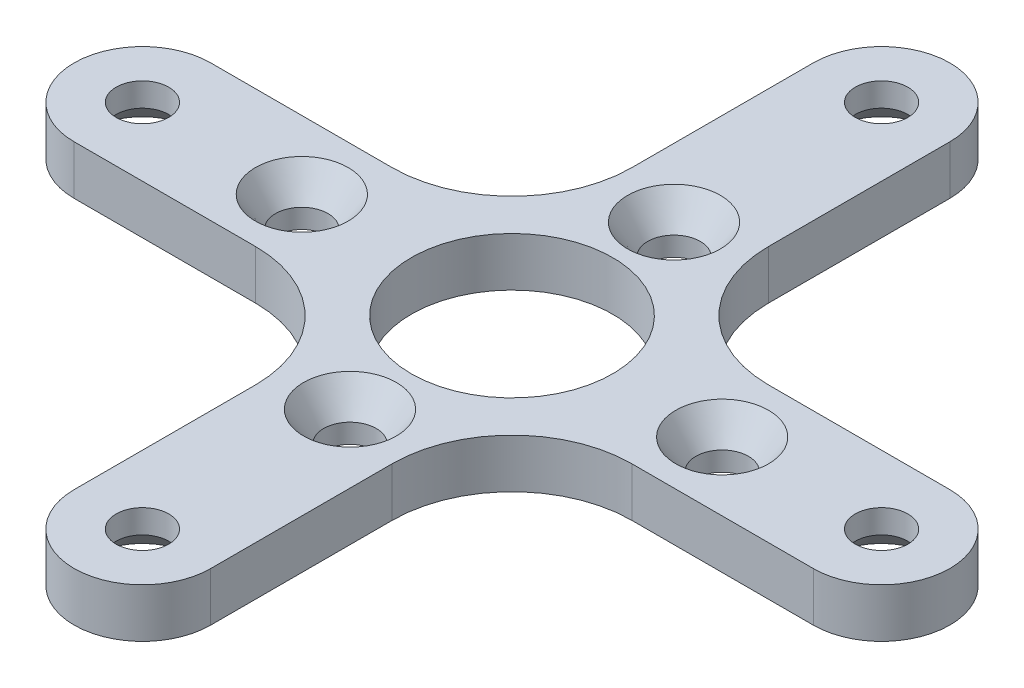
ISO-10303-21;
HEADER;
FILE_DESCRIPTION(('STEP AP214'),'2;1');
FILE_NAME('part.step','',(''),(''),'','','');
FILE_SCHEMA(('AUTOMOTIVE_DESIGN { 1 0 10303 214 1 1 1 1 }'));
ENDSEC;
DATA;
#1=APPLICATION_CONTEXT('core data for automotive mechanical design processes');
#2=APPLICATION_PROTOCOL_DEFINITION('international standard','automotive_design',2000,#1);
#3=PRODUCT_CONTEXT('',#1,'mechanical');
#4=PRODUCT('Part','Part','',(#3));
#5=PRODUCT_RELATED_PRODUCT_CATEGORY('part','',(#4));
#6=PRODUCT_DEFINITION_FORMATION('','',#4);
#7=PRODUCT_DEFINITION_CONTEXT('part definition',#1,'design');
#8=PRODUCT_DEFINITION('design','',#6,#7);
#9=PRODUCT_DEFINITION_SHAPE('','',#8);
#10=(LENGTH_UNIT() NAMED_UNIT(*) SI_UNIT(.MILLI.,.METRE.));
#11=(NAMED_UNIT(*) PLANE_ANGLE_UNIT() SI_UNIT($,.RADIAN.));
#12=(NAMED_UNIT(*) SI_UNIT($,.STERADIAN.) SOLID_ANGLE_UNIT());
#13=UNCERTAINTY_MEASURE_WITH_UNIT(LENGTH_MEASURE(1.E-05),#10,'distance_accuracy_value','');
#14=(GEOMETRIC_REPRESENTATION_CONTEXT(3) GLOBAL_UNCERTAINTY_ASSIGNED_CONTEXT((#13)) GLOBAL_UNIT_ASSIGNED_CONTEXT((#10,
#11,#12)) REPRESENTATION_CONTEXT('',''));
#15=CARTESIAN_POINT('',(0.,0.,0.));
#16=DIRECTION('',(0.,0.,1.));
#17=DIRECTION('',(1.,0.,0.));
#18=AXIS2_PLACEMENT_3D('',#15,#16,#17);
#19=CARTESIAN_POINT('',(0.,1.4,-21.1));
#20=DIRECTION('',(0.,-1.,0.));
#21=DIRECTION('',(0.,0.,-1.));
#22=AXIS2_PLACEMENT_3D('',#19,#20,#21);
#23=PLANE('',#22);
#24=CARTESIAN_POINT('',(12.,1.4,0.));
#25=DIRECTION('',(0.,-1.,0.));
#26=DIRECTION('',(0.,0.,-1.));
#27=AXIS2_PLACEMENT_3D('',#24,#25,#26);
#28=CIRCLE('',#27,2.65);
#29=CARTESIAN_POINT('',(12.,1.4,-2.65));
#30=VERTEX_POINT('',#29);
#31=EDGE_CURVE('E339',#30,#30,#28,.T.);
#32=ORIENTED_EDGE('',*,*,#31,.T.);
#33=EDGE_LOOP('',(#32));
#34=FACE_BOUND('',#33,.T.);
#35=CARTESIAN_POINT('',(0.,1.4,-9.25));
#36=DIRECTION('',(0.,-1.,0.));
#37=DIRECTION('',(0.,0.,-1.));
#38=AXIS2_PLACEMENT_3D('',#35,#36,#37);
#39=CIRCLE('',#38,2.65);
#40=CARTESIAN_POINT('',(0.,1.4,-11.9));
#41=VERTEX_POINT('',#40);
#42=EDGE_CURVE('E335',#41,#41,#39,.T.);
#43=ORIENTED_EDGE('',*,*,#42,.T.);
#44=EDGE_LOOP('',(#43));
#45=FACE_BOUND('',#44,.T.);
#46=CARTESIAN_POINT('',(-12.,1.4,0.));
#47=DIRECTION('',(0.,-1.,0.));
#48=DIRECTION('',(0.,0.,-1.));
#49=AXIS2_PLACEMENT_3D('',#46,#47,#48);
#50=CIRCLE('',#49,2.65);
#51=CARTESIAN_POINT('',(-12.,1.4,-2.65));
#52=VERTEX_POINT('',#51);
#53=EDGE_CURVE('E331',#52,#52,#50,.T.);
#54=ORIENTED_EDGE('',*,*,#53,.T.);
#55=EDGE_LOOP('',(#54));
#56=FACE_BOUND('',#55,.T.);
#57=CARTESIAN_POINT('',(0.,1.4,9.25));
#58=DIRECTION('',(0.,-1.,0.));
#59=DIRECTION('',(0.,0.,-1.));
#60=AXIS2_PLACEMENT_3D('',#57,#58,#59);
#61=CIRCLE('',#60,2.65);
#62=CARTESIAN_POINT('',(0.,1.4,6.6));
#63=VERTEX_POINT('',#62);
#64=EDGE_CURVE('E327',#63,#63,#61,.T.);
#65=ORIENTED_EDGE('',*,*,#64,.T.);
#66=EDGE_LOOP('',(#65));
#67=FACE_BOUND('',#66,.T.);
#68=CARTESIAN_POINT('',(0.,1.4,-21.1));
#69=DIRECTION('',(0.,1.,0.));
#70=DIRECTION('',(0.,0.,-1.));
#71=AXIS2_PLACEMENT_3D('',#68,#69,#70);
#72=CIRCLE('',#71,3.9);
#73=CARTESIAN_POINT('',(3.89999999999999,1.4,-21.1));
#74=VERTEX_POINT('',#73);
#75=CARTESIAN_POINT('',(-3.9,1.4,-21.1));
#76=VERTEX_POINT('',#75);
#77=EDGE_CURVE('E237',#74,#76,#72,.T.);
#78=ORIENTED_EDGE('',*,*,#77,.T.);
#79=DIRECTION('',(0.,0.,1.));
#80=VECTOR('',#79,1.);
#81=CARTESIAN_POINT('',(-3.9,1.4,-21.1));
#82=LINE('',#81,#80);
#83=CARTESIAN_POINT('',(-3.9,1.4,-10.7432503525602));
#84=VERTEX_POINT('',#83);
#85=EDGE_CURVE('E125',#76,#84,#82,.T.);
#86=ORIENTED_EDGE('',*,*,#85,.T.);
#87=CARTESIAN_POINT('',(-10.7432503525602,1.4,-10.7432503525602));
#88=DIRECTION('',(0.,-1.,0.));
#89=DIRECTION('',(0.,0.,1.));
#90=AXIS2_PLACEMENT_3D('',#87,#88,#89);
#91=CIRCLE('',#90,6.84325035256015);
#92=CARTESIAN_POINT('',(-10.7432503525602,1.4,-3.9));
#93=VERTEX_POINT('',#92);
#94=EDGE_CURVE('E501',#84,#93,#91,.T.);
#95=ORIENTED_EDGE('',*,*,#94,.T.);
#96=DIRECTION('',(-1.,0.,0.));
#97=VECTOR('',#96,1.);
#98=CARTESIAN_POINT('',(-21.1,1.4,-3.9));
#99=LINE('',#98,#97);
#100=CARTESIAN_POINT('',(-21.1,1.4,-3.9));
#101=VERTEX_POINT('',#100);
#102=EDGE_CURVE('E504',#93,#101,#99,.T.);
#103=ORIENTED_EDGE('',*,*,#102,.T.);
#104=CARTESIAN_POINT('',(-21.1,1.4,0.));
#105=DIRECTION('',(0.,1.,0.));
#106=DIRECTION('',(0.,0.,-1.));
#107=AXIS2_PLACEMENT_3D('',#104,#105,#106);
#108=CIRCLE('',#107,3.9);
#109=CARTESIAN_POINT('',(-21.1,1.4,3.9));
#110=VERTEX_POINT('',#109);
#111=EDGE_CURVE('E507',#101,#110,#108,.T.);
#112=ORIENTED_EDGE('',*,*,#111,.T.);
#113=DIRECTION('',(1.,0.,0.));
#114=VECTOR('',#113,1.);
#115=CARTESIAN_POINT('',(-10.7432503525602,1.4,3.9));
#116=LINE('',#115,#114);
#117=CARTESIAN_POINT('',(-10.7432503525602,1.4,3.9));
#118=VERTEX_POINT('',#117);
#119=EDGE_CURVE('E510',#110,#118,#116,.T.);
#120=ORIENTED_EDGE('',*,*,#119,.T.);
#121=CARTESIAN_POINT('',(-10.7432503525602,1.4,10.7432503525602));
#122=DIRECTION('',(0.,-1.,0.));
#123=DIRECTION('',(0.,0.,1.));
#124=AXIS2_PLACEMENT_3D('',#121,#122,#123);
#125=CIRCLE('',#124,6.84325035256015);
#126=CARTESIAN_POINT('',(-3.9,1.4,10.7432503525602));
#127=VERTEX_POINT('',#126);
#128=EDGE_CURVE('E513',#118,#127,#125,.T.);
#129=ORIENTED_EDGE('',*,*,#128,.T.);
#130=DIRECTION('',(0.,0.,1.));
#131=VECTOR('',#130,1.);
#132=CARTESIAN_POINT('',(-3.9,1.4,21.1));
#133=LINE('',#132,#131);
#134=CARTESIAN_POINT('',(-3.9,1.4,21.1));
#135=VERTEX_POINT('',#134);
#136=EDGE_CURVE('E516',#127,#135,#133,.T.);
#137=ORIENTED_EDGE('',*,*,#136,.T.);
#138=CARTESIAN_POINT('',(0.,1.4,21.1));
#139=DIRECTION('',(0.,1.,0.));
#140=DIRECTION('',(0.,0.,-1.));
#141=AXIS2_PLACEMENT_3D('',#138,#139,#140);
#142=CIRCLE('',#141,3.89999999999999);
#143=CARTESIAN_POINT('',(3.9,1.4,21.1));
#144=VERTEX_POINT('',#143);
#145=EDGE_CURVE('E519',#135,#144,#142,.T.);
#146=ORIENTED_EDGE('',*,*,#145,.T.);
#147=DIRECTION('',(0.,0.,-1.));
#148=VECTOR('',#147,1.);
#149=CARTESIAN_POINT('',(3.90000000000001,1.4,10.7432503525602));
#150=LINE('',#149,#148);
#151=CARTESIAN_POINT('',(3.90000000000001,1.4,10.7432503525602));
#152=VERTEX_POINT('',#151);
#153=EDGE_CURVE('E522',#144,#152,#150,.T.);
#154=ORIENTED_EDGE('',*,*,#153,.T.);
#155=CARTESIAN_POINT('',(10.7432503525602,1.4,10.7432503525602));
#156=DIRECTION('',(0.,-1.,0.));
#157=DIRECTION('',(0.,0.,1.));
#158=AXIS2_PLACEMENT_3D('',#155,#156,#157);
#159=CIRCLE('',#158,6.84325035256015);
#160=CARTESIAN_POINT('',(10.7432503525602,1.4,3.9));
#161=VERTEX_POINT('',#160);
#162=EDGE_CURVE('E525',#152,#161,#159,.T.);
#163=ORIENTED_EDGE('',*,*,#162,.T.);
#164=DIRECTION('',(1.,0.,0.));
#165=VECTOR('',#164,1.);
#166=CARTESIAN_POINT('',(21.1,1.4,3.9));
#167=LINE('',#166,#165);
#168=CARTESIAN_POINT('',(21.1,1.4,3.9));
#169=VERTEX_POINT('',#168);
#170=EDGE_CURVE('E528',#161,#169,#167,.T.);
#171=ORIENTED_EDGE('',*,*,#170,.T.);
#172=CARTESIAN_POINT('',(21.1,1.4,0.));
#173=DIRECTION('',(0.,1.,0.));
#174=DIRECTION('',(0.,0.,-1.));
#175=AXIS2_PLACEMENT_3D('',#172,#173,#174);
#176=CIRCLE('',#175,3.9);
#177=CARTESIAN_POINT('',(21.1,1.4,-3.9));
#178=VERTEX_POINT('',#177);
#179=EDGE_CURVE('E168',#169,#178,#176,.T.);
#180=ORIENTED_EDGE('',*,*,#179,.T.);
#181=DIRECTION('',(-1.,0.,0.));
#182=VECTOR('',#181,1.);
#183=CARTESIAN_POINT('',(10.7432503525602,1.4,-3.9));
#184=LINE('',#183,#182);
#185=CARTESIAN_POINT('',(10.7432503525602,1.4,-3.9));
#186=VERTEX_POINT('',#185);
#187=EDGE_CURVE('E162',#178,#186,#184,.T.);
#188=ORIENTED_EDGE('',*,*,#187,.T.);
#189=CARTESIAN_POINT('',(10.7432503525602,1.4,-10.7432503525602));
#190=DIRECTION('',(0.,-1.,0.));
#191=DIRECTION('',(0.,0.,1.));
#192=AXIS2_PLACEMENT_3D('',#189,#190,#191);
#193=CIRCLE('',#192,6.84325035256015);
#194=CARTESIAN_POINT('',(3.90000000000001,1.4,-10.7432503525602));
#195=VERTEX_POINT('',#194);
#196=EDGE_CURVE('E166',#186,#195,#193,.T.);
#197=ORIENTED_EDGE('',*,*,#196,.T.);
#198=DIRECTION('',(0.,0.,-1.));
#199=VECTOR('',#198,1.);
#200=CARTESIAN_POINT('',(3.89999999999999,1.4,-21.1));
#201=LINE('',#200,#199);
#202=EDGE_CURVE('E57',#195,#74,#201,.T.);
#203=ORIENTED_EDGE('',*,*,#202,.T.);
#204=EDGE_LOOP('',(#78,#86,#95,#103,#112,#120,#129,#137,#146,#154,#163,#171,#180,#188,#197,#203));
#205=FACE_BOUND('',#204,.T.);
#206=CARTESIAN_POINT('',(0.,1.4,0.));
#207=DIRECTION('',(0.,1.,0.));
#208=DIRECTION('',(0.,0.,1.));
#209=AXIS2_PLACEMENT_3D('',#206,#207,#208);
#210=CIRCLE('',#209,5.75);
#211=CARTESIAN_POINT('',(0.,1.4,5.75));
#212=VERTEX_POINT('',#211);
#213=EDGE_CURVE('E195',#212,#212,#210,.T.);
#214=ORIENTED_EDGE('',*,*,#213,.F.);
#215=EDGE_LOOP('',(#214));
#216=FACE_BOUND('',#215,.T.);
#217=CARTESIAN_POINT('',(0.,1.4,-21.1));
#218=DIRECTION('',(0.,1.,0.));
#219=DIRECTION('',(0.,0.,1.));
#220=AXIS2_PLACEMENT_3D('',#217,#218,#219);
#221=CIRCLE('',#220,1.5);
#222=CARTESIAN_POINT('',(0.,1.4,-19.6));
#223=VERTEX_POINT('',#222);
#224=EDGE_CURVE('E474',#223,#223,#221,.T.);
#225=ORIENTED_EDGE('',*,*,#224,.F.);
#226=EDGE_LOOP('',(#225));
#227=FACE_BOUND('',#226,.T.);
#228=CARTESIAN_POINT('',(21.1,1.4,0.));
#229=DIRECTION('',(0.,1.,0.));
#230=DIRECTION('',(0.,0.,1.));
#231=AXIS2_PLACEMENT_3D('',#228,#229,#230);
#232=CIRCLE('',#231,1.5);
#233=CARTESIAN_POINT('',(21.1,1.4,1.5));
#234=VERTEX_POINT('',#233);
#235=EDGE_CURVE('E475',#234,#234,#232,.T.);
#236=ORIENTED_EDGE('',*,*,#235,.F.);
#237=EDGE_LOOP('',(#236));
#238=FACE_BOUND('',#237,.T.);
#239=CARTESIAN_POINT('',(0.,1.4,21.1));
#240=DIRECTION('',(0.,1.,0.));
#241=DIRECTION('',(0.,0.,1.));
#242=AXIS2_PLACEMENT_3D('',#239,#240,#241);
#243=CIRCLE('',#242,1.5);
#244=CARTESIAN_POINT('',(0.,1.4,22.6));
#245=VERTEX_POINT('',#244);
#246=EDGE_CURVE('E585',#245,#245,#243,.T.);
#247=ORIENTED_EDGE('',*,*,#246,.F.);
#248=EDGE_LOOP('',(#247));
#249=FACE_BOUND('',#248,.T.);
#250=CARTESIAN_POINT('',(-21.1,1.4,0.));
#251=DIRECTION('',(0.,1.,0.));
#252=DIRECTION('',(0.,0.,1.));
#253=AXIS2_PLACEMENT_3D('',#250,#251,#252);
#254=CIRCLE('',#253,1.5);
#255=CARTESIAN_POINT('',(-21.1,1.4,1.5));
#256=VERTEX_POINT('',#255);
#257=EDGE_CURVE('E588',#256,#256,#254,.T.);
#258=ORIENTED_EDGE('',*,*,#257,.F.);
#259=EDGE_LOOP('',(#258));
#260=FACE_BOUND('',#259,.T.);
#261=ADVANCED_FACE('F39',(#34,#45,#56,#67,#205,#216,#227,#238,#249,#260),#23,.F.);
#262=CARTESIAN_POINT('',(0.,-1.4,-21.1));
#263=DIRECTION('',(0.,-1.,0.));
#264=DIRECTION('',(0.,0.,-1.));
#265=AXIS2_PLACEMENT_3D('',#262,#263,#264);
#266=PLANE('',#265);
#267=CARTESIAN_POINT('',(-21.1,-1.4,0.));
#268=DIRECTION('',(0.,-1.,0.));
#269=DIRECTION('',(0.,0.,-1.));
#270=AXIS2_PLACEMENT_3D('',#267,#268,#269);
#271=CIRCLE('',#270,2.95000000000002);
#272=CARTESIAN_POINT('',(-21.1,-1.4,-2.95000000000002));
#273=VERTEX_POINT('',#272);
#274=EDGE_CURVE('E303',#273,#273,#271,.F.);
#275=ORIENTED_EDGE('',*,*,#274,.T.);
#276=EDGE_LOOP('',(#275));
#277=FACE_BOUND('',#276,.T.);
#278=CARTESIAN_POINT('',(0.,-1.4,-21.1));
#279=DIRECTION('',(0.,-1.,0.));
#280=DIRECTION('',(0.,0.,-1.));
#281=AXIS2_PLACEMENT_3D('',#278,#279,#280);
#282=CIRCLE('',#281,2.95000000000002);
#283=CARTESIAN_POINT('',(0.,-1.4,-24.05));
#284=VERTEX_POINT('',#283);
#285=EDGE_CURVE('E299',#284,#284,#282,.F.);
#286=ORIENTED_EDGE('',*,*,#285,.T.);
#287=EDGE_LOOP('',(#286));
#288=FACE_BOUND('',#287,.T.);
#289=CARTESIAN_POINT('',(21.1,-1.4,0.));
#290=DIRECTION('',(0.,-1.,0.));
#291=DIRECTION('',(0.,0.,-1.));
#292=AXIS2_PLACEMENT_3D('',#289,#290,#291);
#293=CIRCLE('',#292,2.95000000000002);
#294=CARTESIAN_POINT('',(21.1,-1.4,-2.95000000000002));
#295=VERTEX_POINT('',#294);
#296=EDGE_CURVE('E295',#295,#295,#293,.F.);
#297=ORIENTED_EDGE('',*,*,#296,.T.);
#298=EDGE_LOOP('',(#297));
#299=FACE_BOUND('',#298,.T.);
#300=CARTESIAN_POINT('',(0.,-1.4,21.1));
#301=DIRECTION('',(0.,-1.,0.));
#302=DIRECTION('',(0.,0.,-1.));
#303=AXIS2_PLACEMENT_3D('',#300,#301,#302);
#304=CIRCLE('',#303,2.94999999999999);
#305=CARTESIAN_POINT('',(0.,-1.4,18.15));
#306=VERTEX_POINT('',#305);
#307=EDGE_CURVE('E291',#306,#306,#304,.F.);
#308=ORIENTED_EDGE('',*,*,#307,.T.);
#309=EDGE_LOOP('',(#308));
#310=FACE_BOUND('',#309,.T.);
#311=CARTESIAN_POINT('',(-12.,-1.4,0.));
#312=DIRECTION('',(0.,1.,0.));
#313=DIRECTION('',(0.,0.,1.));
#314=AXIS2_PLACEMENT_3D('',#311,#312,#313);
#315=CIRCLE('',#314,1.5);
#316=CARTESIAN_POINT('',(-12.,-1.4,1.5));
#317=VERTEX_POINT('',#316);
#318=EDGE_CURVE('E591',#317,#317,#315,.T.);
#319=ORIENTED_EDGE('',*,*,#318,.T.);
#320=EDGE_LOOP('',(#319));
#321=FACE_BOUND('',#320,.T.);
#322=CARTESIAN_POINT('',(0.,-1.4,9.25));
#323=DIRECTION('',(0.,1.,0.));
#324=DIRECTION('',(0.,0.,1.));
#325=AXIS2_PLACEMENT_3D('',#322,#323,#324);
#326=CIRCLE('',#325,1.5);
#327=CARTESIAN_POINT('',(0.,-1.4,10.75));
#328=VERTEX_POINT('',#327);
#329=EDGE_CURVE('E483',#328,#328,#326,.T.);
#330=ORIENTED_EDGE('',*,*,#329,.T.);
#331=EDGE_LOOP('',(#330));
#332=FACE_BOUND('',#331,.T.);
#333=CARTESIAN_POINT('',(12.,-1.4,0.));
#334=DIRECTION('',(0.,1.,0.));
#335=DIRECTION('',(0.,0.,1.));
#336=AXIS2_PLACEMENT_3D('',#333,#334,#335);
#337=CIRCLE('',#336,1.5);
#338=CARTESIAN_POINT('',(12.,-1.4,1.5));
#339=VERTEX_POINT('',#338);
#340=EDGE_CURVE('E471',#339,#339,#337,.T.);
#341=ORIENTED_EDGE('',*,*,#340,.T.);
#342=EDGE_LOOP('',(#341));
#343=FACE_BOUND('',#342,.T.);
#344=CARTESIAN_POINT('',(0.,-1.4,-9.25));
#345=DIRECTION('',(0.,1.,0.));
#346=DIRECTION('',(0.,0.,1.));
#347=AXIS2_PLACEMENT_3D('',#344,#345,#346);
#348=CIRCLE('',#347,1.5);
#349=CARTESIAN_POINT('',(0.,-1.4,-7.75));
#350=VERTEX_POINT('',#349);
#351=EDGE_CURVE('E480',#350,#350,#348,.T.);
#352=ORIENTED_EDGE('',*,*,#351,.T.);
#353=EDGE_LOOP('',(#352));
#354=FACE_BOUND('',#353,.T.);
#355=CARTESIAN_POINT('',(0.,-1.4,-21.1));
#356=DIRECTION('',(0.,1.,0.));
#357=DIRECTION('',(0.,0.,-1.));
#358=AXIS2_PLACEMENT_3D('',#355,#356,#357);
#359=CIRCLE('',#358,3.9);
#360=CARTESIAN_POINT('',(3.89999999999999,-1.4,-21.1));
#361=VERTEX_POINT('',#360);
#362=CARTESIAN_POINT('',(-3.9,-1.4,-21.1));
#363=VERTEX_POINT('',#362);
#364=EDGE_CURVE('E190',#361,#363,#359,.T.);
#365=ORIENTED_EDGE('',*,*,#364,.F.);
#366=DIRECTION('',(0.,0.,-1.));
#367=VECTOR('',#366,1.);
#368=CARTESIAN_POINT('',(3.89999999999999,-1.4,-21.1));
#369=LINE('',#368,#367);
#370=CARTESIAN_POINT('',(3.90000000000001,-1.4,-10.7432503525602));
#371=VERTEX_POINT('',#370);
#372=EDGE_CURVE('E116',#371,#361,#369,.T.);
#373=ORIENTED_EDGE('',*,*,#372,.F.);
#374=CARTESIAN_POINT('',(10.7432503525602,-1.4,-10.7432503525602));
#375=DIRECTION('',(0.,-1.,0.));
#376=DIRECTION('',(0.,0.,1.));
#377=AXIS2_PLACEMENT_3D('',#374,#375,#376);
#378=CIRCLE('',#377,6.84325035256015);
#379=CARTESIAN_POINT('',(10.7432503525602,-1.4,-3.9));
#380=VERTEX_POINT('',#379);
#381=EDGE_CURVE('E110',#380,#371,#378,.T.);
#382=ORIENTED_EDGE('',*,*,#381,.F.);
#383=DIRECTION('',(-1.,0.,0.));
#384=VECTOR('',#383,1.);
#385=CARTESIAN_POINT('',(10.7432503525602,-1.4,-3.9));
#386=LINE('',#385,#384);
#387=CARTESIAN_POINT('',(21.1,-1.4,-3.9));
#388=VERTEX_POINT('',#387);
#389=EDGE_CURVE('E177',#388,#380,#386,.T.);
#390=ORIENTED_EDGE('',*,*,#389,.F.);
#391=CARTESIAN_POINT('',(21.1,-1.4,0.));
#392=DIRECTION('',(0.,1.,0.));
#393=DIRECTION('',(0.,0.,-1.));
#394=AXIS2_PLACEMENT_3D('',#391,#392,#393);
#395=CIRCLE('',#394,3.9);
#396=CARTESIAN_POINT('',(21.1,-1.4,3.9));
#397=VERTEX_POINT('',#396);
#398=EDGE_CURVE('E228',#397,#388,#395,.T.);
#399=ORIENTED_EDGE('',*,*,#398,.F.);
#400=DIRECTION('',(1.,0.,0.));
#401=VECTOR('',#400,1.);
#402=CARTESIAN_POINT('',(21.1,-1.4,3.9));
#403=LINE('',#402,#401);
#404=CARTESIAN_POINT('',(10.7432503525602,-1.4,3.9));
#405=VERTEX_POINT('',#404);
#406=EDGE_CURVE('E225',#405,#397,#403,.T.);
#407=ORIENTED_EDGE('',*,*,#406,.F.);
#408=CARTESIAN_POINT('',(10.7432503525602,-1.4,10.7432503525602));
#409=DIRECTION('',(0.,-1.,0.));
#410=DIRECTION('',(0.,0.,1.));
#411=AXIS2_PLACEMENT_3D('',#408,#409,#410);
#412=CIRCLE('',#411,6.84325035256015);
#413=CARTESIAN_POINT('',(3.90000000000001,-1.4,10.7432503525602));
#414=VERTEX_POINT('',#413);
#415=EDGE_CURVE('E222',#414,#405,#412,.T.);
#416=ORIENTED_EDGE('',*,*,#415,.F.);
#417=DIRECTION('',(0.,0.,-1.));
#418=VECTOR('',#417,1.);
#419=CARTESIAN_POINT('',(3.90000000000001,-1.4,10.7432503525602));
#420=LINE('',#419,#418);
#421=CARTESIAN_POINT('',(3.9,-1.4,21.1));
#422=VERTEX_POINT('',#421);
#423=EDGE_CURVE('E219',#422,#414,#420,.T.);
#424=ORIENTED_EDGE('',*,*,#423,.F.);
#425=CARTESIAN_POINT('',(0.,-1.4,21.1));
#426=DIRECTION('',(0.,1.,0.));
#427=DIRECTION('',(0.,0.,-1.));
#428=AXIS2_PLACEMENT_3D('',#425,#426,#427);
#429=CIRCLE('',#428,3.89999999999999);
#430=CARTESIAN_POINT('',(-3.9,-1.4,21.1));
#431=VERTEX_POINT('',#430);
#432=EDGE_CURVE('E216',#431,#422,#429,.T.);
#433=ORIENTED_EDGE('',*,*,#432,.F.);
#434=DIRECTION('',(0.,0.,1.));
#435=VECTOR('',#434,1.);
#436=CARTESIAN_POINT('',(-3.9,-1.4,21.1));
#437=LINE('',#436,#435);
#438=CARTESIAN_POINT('',(-3.9,-1.4,10.7432503525602));
#439=VERTEX_POINT('',#438);
#440=EDGE_CURVE('E213',#439,#431,#437,.T.);
#441=ORIENTED_EDGE('',*,*,#440,.F.);
#442=CARTESIAN_POINT('',(-10.7432503525602,-1.4,10.7432503525602));
#443=DIRECTION('',(0.,-1.,0.));
#444=DIRECTION('',(0.,0.,1.));
#445=AXIS2_PLACEMENT_3D('',#442,#443,#444);
#446=CIRCLE('',#445,6.84325035256015);
#447=CARTESIAN_POINT('',(-10.7432503525602,-1.4,3.9));
#448=VERTEX_POINT('',#447);
#449=EDGE_CURVE('E210',#448,#439,#446,.T.);
#450=ORIENTED_EDGE('',*,*,#449,.F.);
#451=DIRECTION('',(1.,0.,0.));
#452=VECTOR('',#451,1.);
#453=CARTESIAN_POINT('',(-10.7432503525602,-1.4,3.9));
#454=LINE('',#453,#452);
#455=CARTESIAN_POINT('',(-21.1,-1.4,3.9));
#456=VERTEX_POINT('',#455);
#457=EDGE_CURVE('E207',#456,#448,#454,.T.);
#458=ORIENTED_EDGE('',*,*,#457,.F.);
#459=CARTESIAN_POINT('',(-21.1,-1.4,0.));
#460=DIRECTION('',(0.,1.,0.));
#461=DIRECTION('',(0.,0.,-1.));
#462=AXIS2_PLACEMENT_3D('',#459,#460,#461);
#463=CIRCLE('',#462,3.9);
#464=CARTESIAN_POINT('',(-21.1,-1.4,-3.9));
#465=VERTEX_POINT('',#464);
#466=EDGE_CURVE('E204',#465,#456,#463,.T.);
#467=ORIENTED_EDGE('',*,*,#466,.F.);
#468=DIRECTION('',(-1.,0.,0.));
#469=VECTOR('',#468,1.);
#470=CARTESIAN_POINT('',(-21.1,-1.4,-3.9));
#471=LINE('',#470,#469);
#472=CARTESIAN_POINT('',(-10.7432503525602,-1.4,-3.9));
#473=VERTEX_POINT('',#472);
#474=EDGE_CURVE('E201',#473,#465,#471,.T.);
#475=ORIENTED_EDGE('',*,*,#474,.F.);
#476=CARTESIAN_POINT('',(-10.7432503525602,-1.4,-10.7432503525602));
#477=DIRECTION('',(0.,-1.,0.));
#478=DIRECTION('',(0.,0.,1.));
#479=AXIS2_PLACEMENT_3D('',#476,#477,#478);
#480=CIRCLE('',#479,6.84325035256015);
#481=CARTESIAN_POINT('',(-3.9,-1.4,-10.7432503525602));
#482=VERTEX_POINT('',#481);
#483=EDGE_CURVE('E198',#482,#473,#480,.T.);
#484=ORIENTED_EDGE('',*,*,#483,.F.);
#485=DIRECTION('',(0.,0.,1.));
#486=VECTOR('',#485,1.);
#487=CARTESIAN_POINT('',(-3.9,-1.4,-21.1));
#488=LINE('',#487,#486);
#489=EDGE_CURVE('E194',#363,#482,#488,.T.);
#490=ORIENTED_EDGE('',*,*,#489,.F.);
#491=EDGE_LOOP('',(#365,#373,#382,#390,#399,#407,#416,#424,#433,#441,#450,#458,#467,#475,#484,#490));
#492=FACE_BOUND('',#491,.T.);
#493=CARTESIAN_POINT('',(0.,-1.4,0.));
#494=DIRECTION('',(0.,1.,0.));
#495=DIRECTION('',(0.,0.,1.));
#496=AXIS2_PLACEMENT_3D('',#493,#494,#495);
#497=CIRCLE('',#496,5.75);
#498=CARTESIAN_POINT('',(0.,-1.4,5.75));
#499=VERTEX_POINT('',#498);
#500=EDGE_CURVE('E490',#499,#499,#497,.T.);
#501=ORIENTED_EDGE('',*,*,#500,.T.);
#502=EDGE_LOOP('',(#501));
#503=FACE_BOUND('',#502,.T.);
#504=ADVANCED_FACE('F367',(#277,#288,#299,#310,#321,#332,#343,#354,#492,#503),#266,.T.);
#505=CARTESIAN_POINT('',(0.,1.4,-21.1));
#506=DIRECTION('',(0.,-1.,0.));
#507=DIRECTION('',(0.,0.,-1.));
#508=AXIS2_PLACEMENT_3D('',#505,#506,#507);
#509=CYLINDRICAL_SURFACE('',#508,3.9);
#510=ORIENTED_EDGE('',*,*,#364,.T.);
#511=DIRECTION('',(0.,-1.,0.));
#512=VECTOR('',#511,1.);
#513=CARTESIAN_POINT('',(-3.9,1.4,-21.1));
#514=LINE('',#513,#512);
#515=EDGE_CURVE('E288',#76,#363,#514,.T.);
#516=ORIENTED_EDGE('',*,*,#515,.F.);
#517=ORIENTED_EDGE('',*,*,#77,.F.);
#518=DIRECTION('',(0.,-1.,0.));
#519=VECTOR('',#518,1.);
#520=CARTESIAN_POINT('',(3.89999999999999,1.4,-21.1));
#521=LINE('',#520,#519);
#522=EDGE_CURVE('E186',#74,#361,#521,.T.);
#523=ORIENTED_EDGE('',*,*,#522,.T.);
#524=EDGE_LOOP('',(#510,#516,#517,#523));
#525=FACE_BOUND('',#524,.T.);
#526=ADVANCED_FACE('F373',(#525),#509,.T.);
#527=CARTESIAN_POINT('',(-3.9,1.4,-21.1));
#528=DIRECTION('',(1.,0.,0.));
#529=DIRECTION('',(0.,0.,-1.));
#530=AXIS2_PLACEMENT_3D('',#527,#528,#529);
#531=PLANE('',#530);
#532=ORIENTED_EDGE('',*,*,#489,.T.);
#533=DIRECTION('',(0.,-1.,0.));
#534=VECTOR('',#533,1.);
#535=CARTESIAN_POINT('',(-3.9,1.4,-10.7432503525602));
#536=LINE('',#535,#534);
#537=EDGE_CURVE('E284',#84,#482,#536,.T.);
#538=ORIENTED_EDGE('',*,*,#537,.F.);
#539=ORIENTED_EDGE('',*,*,#85,.F.);
#540=ORIENTED_EDGE('',*,*,#515,.T.);
#541=EDGE_LOOP('',(#532,#538,#539,#540));
#542=FACE_BOUND('',#541,.T.);
#543=ADVANCED_FACE('F431',(#542),#531,.F.);
#544=CARTESIAN_POINT('',(-10.7432503525602,1.4,-10.7432503525602));
#545=DIRECTION('',(0.,-1.,0.));
#546=DIRECTION('',(0.,0.,-1.));
#547=AXIS2_PLACEMENT_3D('',#544,#545,#546);
#548=CYLINDRICAL_SURFACE('',#547,6.84325035256015);
#549=ORIENTED_EDGE('',*,*,#483,.T.);
#550=DIRECTION('',(0.,-1.,0.));
#551=VECTOR('',#550,1.);
#552=CARTESIAN_POINT('',(-10.7432503525602,1.4,-3.9));
#553=LINE('',#552,#551);
#554=EDGE_CURVE('E280',#93,#473,#553,.T.);
#555=ORIENTED_EDGE('',*,*,#554,.F.);
#556=ORIENTED_EDGE('',*,*,#94,.F.);
#557=ORIENTED_EDGE('',*,*,#537,.T.);
#558=EDGE_LOOP('',(#549,#555,#556,#557));
#559=FACE_BOUND('',#558,.T.);
#560=ADVANCED_FACE('F427',(#559),#548,.F.);
#561=CARTESIAN_POINT('',(-21.1,1.4,-3.9));
#562=DIRECTION('',(0.,0.,1.));
#563=DIRECTION('',(1.,0.,0.));
#564=AXIS2_PLACEMENT_3D('',#561,#562,#563);
#565=PLANE('',#564);
#566=ORIENTED_EDGE('',*,*,#474,.T.);
#567=DIRECTION('',(0.,-1.,0.));
#568=VECTOR('',#567,1.);
#569=CARTESIAN_POINT('',(-21.1,1.4,-3.9));
#570=LINE('',#569,#568);
#571=EDGE_CURVE('E276',#101,#465,#570,.T.);
#572=ORIENTED_EDGE('',*,*,#571,.F.);
#573=ORIENTED_EDGE('',*,*,#102,.F.);
#574=ORIENTED_EDGE('',*,*,#554,.T.);
#575=EDGE_LOOP('',(#566,#572,#573,#574));
#576=FACE_BOUND('',#575,.T.);
#577=ADVANCED_FACE('F423',(#576),#565,.F.);
#578=CARTESIAN_POINT('',(-21.1,1.4,0.));
#579=DIRECTION('',(0.,-1.,0.));
#580=DIRECTION('',(0.,0.,-1.));
#581=AXIS2_PLACEMENT_3D('',#578,#579,#580);
#582=CYLINDRICAL_SURFACE('',#581,3.9);
#583=ORIENTED_EDGE('',*,*,#466,.T.);
#584=DIRECTION('',(0.,-1.,0.));
#585=VECTOR('',#584,1.);
#586=CARTESIAN_POINT('',(-21.1,1.4,3.9));
#587=LINE('',#586,#585);
#588=EDGE_CURVE('E272',#110,#456,#587,.T.);
#589=ORIENTED_EDGE('',*,*,#588,.F.);
#590=ORIENTED_EDGE('',*,*,#111,.F.);
#591=ORIENTED_EDGE('',*,*,#571,.T.);
#592=EDGE_LOOP('',(#583,#589,#590,#591));
#593=FACE_BOUND('',#592,.T.);
#594=ADVANCED_FACE('F419',(#593),#582,.T.);
#595=CARTESIAN_POINT('',(-10.7432503525602,1.4,3.9));
#596=DIRECTION('',(0.,0.,-1.));
#597=DIRECTION('',(-1.,0.,0.));
#598=AXIS2_PLACEMENT_3D('',#595,#596,#597);
#599=PLANE('',#598);
#600=ORIENTED_EDGE('',*,*,#457,.T.);
#601=DIRECTION('',(0.,-1.,0.));
#602=VECTOR('',#601,1.);
#603=CARTESIAN_POINT('',(-10.7432503525602,1.4,3.9));
#604=LINE('',#603,#602);
#605=EDGE_CURVE('E268',#118,#448,#604,.T.);
#606=ORIENTED_EDGE('',*,*,#605,.F.);
#607=ORIENTED_EDGE('',*,*,#119,.F.);
#608=ORIENTED_EDGE('',*,*,#588,.T.);
#609=EDGE_LOOP('',(#600,#606,#607,#608));
#610=FACE_BOUND('',#609,.T.);
#611=ADVANCED_FACE('F415',(#610),#599,.F.);
#612=CARTESIAN_POINT('',(-10.7432503525602,1.4,10.7432503525602));
#613=DIRECTION('',(0.,-1.,0.));
#614=DIRECTION('',(0.,0.,-1.));
#615=AXIS2_PLACEMENT_3D('',#612,#613,#614);
#616=CYLINDRICAL_SURFACE('',#615,6.84325035256015);
#617=ORIENTED_EDGE('',*,*,#449,.T.);
#618=DIRECTION('',(0.,-1.,0.));
#619=VECTOR('',#618,1.);
#620=CARTESIAN_POINT('',(-3.9,1.4,10.7432503525602));
#621=LINE('',#620,#619);
#622=EDGE_CURVE('E264',#127,#439,#621,.T.);
#623=ORIENTED_EDGE('',*,*,#622,.F.);
#624=ORIENTED_EDGE('',*,*,#128,.F.);
#625=ORIENTED_EDGE('',*,*,#605,.T.);
#626=EDGE_LOOP('',(#617,#623,#624,#625));
#627=FACE_BOUND('',#626,.T.);
#628=ADVANCED_FACE('F411',(#627),#616,.F.);
#629=CARTESIAN_POINT('',(-3.9,1.4,21.1));
#630=DIRECTION('',(1.,0.,0.));
#631=DIRECTION('',(0.,0.,-1.));
#632=AXIS2_PLACEMENT_3D('',#629,#630,#631);
#633=PLANE('',#632);
#634=ORIENTED_EDGE('',*,*,#440,.T.);
#635=DIRECTION('',(0.,-1.,0.));
#636=VECTOR('',#635,1.);
#637=CARTESIAN_POINT('',(-3.9,1.4,21.1));
#638=LINE('',#637,#636);
#639=EDGE_CURVE('E260',#135,#431,#638,.T.);
#640=ORIENTED_EDGE('',*,*,#639,.F.);
#641=ORIENTED_EDGE('',*,*,#136,.F.);
#642=ORIENTED_EDGE('',*,*,#622,.T.);
#643=EDGE_LOOP('',(#634,#640,#641,#642));
#644=FACE_BOUND('',#643,.T.);
#645=ADVANCED_FACE('F407',(#644),#633,.F.);
#646=CARTESIAN_POINT('',(0.,1.4,21.1));
#647=DIRECTION('',(0.,-1.,0.));
#648=DIRECTION('',(0.,0.,-1.));
#649=AXIS2_PLACEMENT_3D('',#646,#647,#648);
#650=CYLINDRICAL_SURFACE('',#649,3.89999999999999);
#651=ORIENTED_EDGE('',*,*,#432,.T.);
#652=DIRECTION('',(0.,-1.,0.));
#653=VECTOR('',#652,1.);
#654=CARTESIAN_POINT('',(3.9,1.4,21.1));
#655=LINE('',#654,#653);
#656=EDGE_CURVE('E256',#144,#422,#655,.T.);
#657=ORIENTED_EDGE('',*,*,#656,.F.);
#658=ORIENTED_EDGE('',*,*,#145,.F.);
#659=ORIENTED_EDGE('',*,*,#639,.T.);
#660=EDGE_LOOP('',(#651,#657,#658,#659));
#661=FACE_BOUND('',#660,.T.);
#662=ADVANCED_FACE('F403',(#661),#650,.T.);
#663=CARTESIAN_POINT('',(3.90000000000001,1.4,10.7432503525602));
#664=DIRECTION('',(-1.,0.,0.));
#665=DIRECTION('',(0.,0.,1.));
#666=AXIS2_PLACEMENT_3D('',#663,#664,#665);
#667=PLANE('',#666);
#668=ORIENTED_EDGE('',*,*,#423,.T.);
#669=DIRECTION('',(0.,-1.,0.));
#670=VECTOR('',#669,1.);
#671=CARTESIAN_POINT('',(3.90000000000001,1.4,10.7432503525602));
#672=LINE('',#671,#670);
#673=EDGE_CURVE('E252',#152,#414,#672,.T.);
#674=ORIENTED_EDGE('',*,*,#673,.F.);
#675=ORIENTED_EDGE('',*,*,#153,.F.);
#676=ORIENTED_EDGE('',*,*,#656,.T.);
#677=EDGE_LOOP('',(#668,#674,#675,#676));
#678=FACE_BOUND('',#677,.T.);
#679=ADVANCED_FACE('F399',(#678),#667,.F.);
#680=CARTESIAN_POINT('',(10.7432503525602,1.4,10.7432503525602));
#681=DIRECTION('',(0.,-1.,0.));
#682=DIRECTION('',(0.,0.,-1.));
#683=AXIS2_PLACEMENT_3D('',#680,#681,#682);
#684=CYLINDRICAL_SURFACE('',#683,6.84325035256015);
#685=ORIENTED_EDGE('',*,*,#415,.T.);
#686=DIRECTION('',(0.,-1.,0.));
#687=VECTOR('',#686,1.);
#688=CARTESIAN_POINT('',(10.7432503525602,1.4,3.9));
#689=LINE('',#688,#687);
#690=EDGE_CURVE('E248',#161,#405,#689,.T.);
#691=ORIENTED_EDGE('',*,*,#690,.F.);
#692=ORIENTED_EDGE('',*,*,#162,.F.);
#693=ORIENTED_EDGE('',*,*,#673,.T.);
#694=EDGE_LOOP('',(#685,#691,#692,#693));
#695=FACE_BOUND('',#694,.T.);
#696=ADVANCED_FACE('F395',(#695),#684,.F.);
#697=CARTESIAN_POINT('',(21.1,1.4,3.9));
#698=DIRECTION('',(0.,0.,-1.));
#699=DIRECTION('',(-1.,0.,0.));
#700=AXIS2_PLACEMENT_3D('',#697,#698,#699);
#701=PLANE('',#700);
#702=ORIENTED_EDGE('',*,*,#406,.T.);
#703=DIRECTION('',(0.,-1.,0.));
#704=VECTOR('',#703,1.);
#705=CARTESIAN_POINT('',(21.1,1.4,3.9));
#706=LINE('',#705,#704);
#707=EDGE_CURVE('E244',#169,#397,#706,.T.);
#708=ORIENTED_EDGE('',*,*,#707,.F.);
#709=ORIENTED_EDGE('',*,*,#170,.F.);
#710=ORIENTED_EDGE('',*,*,#690,.T.);
#711=EDGE_LOOP('',(#702,#708,#709,#710));
#712=FACE_BOUND('',#711,.T.);
#713=ADVANCED_FACE('F391',(#712),#701,.F.);
#714=CARTESIAN_POINT('',(21.1,1.4,0.));
#715=DIRECTION('',(0.,-1.,0.));
#716=DIRECTION('',(0.,0.,-1.));
#717=AXIS2_PLACEMENT_3D('',#714,#715,#716);
#718=CYLINDRICAL_SURFACE('',#717,3.9);
#719=ORIENTED_EDGE('',*,*,#398,.T.);
#720=DIRECTION('',(0.,-1.,0.));
#721=VECTOR('',#720,1.);
#722=CARTESIAN_POINT('',(21.1,1.4,-3.9));
#723=LINE('',#722,#721);
#724=EDGE_CURVE('E179',#178,#388,#723,.T.);
#725=ORIENTED_EDGE('',*,*,#724,.F.);
#726=ORIENTED_EDGE('',*,*,#179,.F.);
#727=ORIENTED_EDGE('',*,*,#707,.T.);
#728=EDGE_LOOP('',(#719,#725,#726,#727));
#729=FACE_BOUND('',#728,.T.);
#730=ADVANCED_FACE('F388',(#729),#718,.T.);
#731=CARTESIAN_POINT('',(10.7432503525602,1.4,-3.9));
#732=DIRECTION('',(0.,0.,1.));
#733=DIRECTION('',(1.,0.,0.));
#734=AXIS2_PLACEMENT_3D('',#731,#732,#733);
#735=PLANE('',#734);
#736=ORIENTED_EDGE('',*,*,#389,.T.);
#737=DIRECTION('',(0.,-1.,0.));
#738=VECTOR('',#737,1.);
#739=CARTESIAN_POINT('',(10.7432503525602,1.4,-3.9));
#740=LINE('',#739,#738);
#741=EDGE_CURVE('E174',#186,#380,#740,.T.);
#742=ORIENTED_EDGE('',*,*,#741,.F.);
#743=ORIENTED_EDGE('',*,*,#187,.F.);
#744=ORIENTED_EDGE('',*,*,#724,.T.);
#745=EDGE_LOOP('',(#736,#742,#743,#744));
#746=FACE_BOUND('',#745,.T.);
#747=ADVANCED_FACE('F175',(#746),#735,.F.);
#748=CARTESIAN_POINT('',(10.7432503525602,1.4,-10.7432503525602));
#749=DIRECTION('',(0.,-1.,0.));
#750=DIRECTION('',(0.,0.,-1.));
#751=AXIS2_PLACEMENT_3D('',#748,#749,#750);
#752=CYLINDRICAL_SURFACE('',#751,6.84325035256015);
#753=ORIENTED_EDGE('',*,*,#381,.T.);
#754=DIRECTION('',(0.,-1.,0.));
#755=VECTOR('',#754,1.);
#756=CARTESIAN_POINT('',(3.90000000000001,1.4,-10.7432503525602));
#757=LINE('',#756,#755);
#758=EDGE_CURVE('E180',#195,#371,#757,.T.);
#759=ORIENTED_EDGE('',*,*,#758,.F.);
#760=ORIENTED_EDGE('',*,*,#196,.F.);
#761=ORIENTED_EDGE('',*,*,#741,.T.);
#762=EDGE_LOOP('',(#753,#759,#760,#761));
#763=FACE_BOUND('',#762,.T.);
#764=ADVANCED_FACE('F182',(#763),#752,.F.);
#765=CARTESIAN_POINT('',(3.89999999999999,1.4,-21.1));
#766=DIRECTION('',(-1.,0.,0.));
#767=DIRECTION('',(0.,0.,1.));
#768=AXIS2_PLACEMENT_3D('',#765,#766,#767);
#769=PLANE('',#768);
#770=ORIENTED_EDGE('',*,*,#372,.T.);
#771=ORIENTED_EDGE('',*,*,#522,.F.);
#772=ORIENTED_EDGE('',*,*,#202,.F.);
#773=ORIENTED_EDGE('',*,*,#758,.T.);
#774=EDGE_LOOP('',(#770,#771,#772,#773));
#775=FACE_BOUND('',#774,.T.);
#776=ADVANCED_FACE('F381',(#775),#769,.F.);
#777=CARTESIAN_POINT('',(0.,1.4,0.));
#778=DIRECTION('',(0.,-1.,0.));
#779=DIRECTION('',(0.,0.,-1.));
#780=AXIS2_PLACEMENT_3D('',#777,#778,#779);
#781=CYLINDRICAL_SURFACE('',#780,5.75);
#782=ORIENTED_EDGE('',*,*,#213,.T.);
#783=EDGE_LOOP('',(#782));
#784=FACE_BOUND('',#783,.T.);
#785=ORIENTED_EDGE('',*,*,#500,.F.);
#786=EDGE_LOOP('',(#785));
#787=FACE_BOUND('',#786,.T.);
#788=ADVANCED_FACE('F378',(#784,#787),#781,.F.);
#789=CARTESIAN_POINT('',(0.,1.4,-9.25));
#790=DIRECTION('',(0.,-1.,0.));
#791=DIRECTION('',(0.,0.,-1.));
#792=AXIS2_PLACEMENT_3D('',#789,#790,#791);
#793=CYLINDRICAL_SURFACE('',#792,1.5);
#794=CARTESIAN_POINT('',(0.,-0.3,-9.25));
#795=DIRECTION('',(0.,-1.,0.));
#796=DIRECTION('',(0.,0.,-1.));
#797=AXIS2_PLACEMENT_3D('',#794,#795,#796);
#798=CIRCLE('',#797,1.5);
#799=CARTESIAN_POINT('',(0.,-0.3,-10.75));
#800=VERTEX_POINT('',#799);
#801=EDGE_CURVE('E343',#800,#800,#798,.F.);
#802=ORIENTED_EDGE('',*,*,#801,.T.);
#803=EDGE_LOOP('',(#802));
#804=FACE_BOUND('',#803,.T.);
#805=ORIENTED_EDGE('',*,*,#351,.F.);
#806=EDGE_LOOP('',(#805));
#807=FACE_BOUND('',#806,.T.);
#808=ADVANCED_FACE('F570',(#804,#807),#793,.F.);
#809=CARTESIAN_POINT('',(0.,1.4,-21.1));
#810=DIRECTION('',(0.,-1.,0.));
#811=DIRECTION('',(0.,0.,-1.));
#812=AXIS2_PLACEMENT_3D('',#809,#810,#811);
#813=CYLINDRICAL_SURFACE('',#812,1.5);
#814=CARTESIAN_POINT('',(0.,0.0500000000000127,-21.1));
#815=DIRECTION('',(0.,-1.,0.));
#816=DIRECTION('',(0.,0.,-1.));
#817=AXIS2_PLACEMENT_3D('',#814,#815,#816);
#818=CIRCLE('',#817,1.5);
#819=CARTESIAN_POINT('',(0.,0.0500000000000127,-22.6));
#820=VERTEX_POINT('',#819);
#821=EDGE_CURVE('E311',#820,#820,#818,.T.);
#822=ORIENTED_EDGE('',*,*,#821,.T.);
#823=EDGE_LOOP('',(#822));
#824=FACE_BOUND('',#823,.T.);
#825=ORIENTED_EDGE('',*,*,#224,.T.);
#826=EDGE_LOOP('',(#825));
#827=FACE_BOUND('',#826,.T.);
#828=ADVANCED_FACE('F467',(#824,#827),#813,.F.);
#829=CARTESIAN_POINT('',(12.,1.4,0.));
#830=DIRECTION('',(0.,-1.,0.));
#831=DIRECTION('',(0.,0.,-1.));
#832=AXIS2_PLACEMENT_3D('',#829,#830,#831);
#833=CYLINDRICAL_SURFACE('',#832,1.5);
#834=CARTESIAN_POINT('',(12.,-0.300000000000012,0.));
#835=DIRECTION('',(0.,-1.,0.));
#836=DIRECTION('',(0.,0.,-1.));
#837=AXIS2_PLACEMENT_3D('',#834,#835,#836);
#838=CIRCLE('',#837,1.5);
#839=CARTESIAN_POINT('',(12.,-0.300000000000012,-1.5));
#840=VERTEX_POINT('',#839);
#841=EDGE_CURVE('E323',#840,#840,#838,.F.);
#842=ORIENTED_EDGE('',*,*,#841,.T.);
#843=EDGE_LOOP('',(#842));
#844=FACE_BOUND('',#843,.T.);
#845=ORIENTED_EDGE('',*,*,#340,.F.);
#846=EDGE_LOOP('',(#845));
#847=FACE_BOUND('',#846,.T.);
#848=ADVANCED_FACE('F463',(#844,#847),#833,.F.);
#849=CARTESIAN_POINT('',(21.1,1.4,0.));
#850=DIRECTION('',(0.,-1.,0.));
#851=DIRECTION('',(0.,0.,-1.));
#852=AXIS2_PLACEMENT_3D('',#849,#850,#851);
#853=CYLINDRICAL_SURFACE('',#852,1.5);
#854=CARTESIAN_POINT('',(21.1,0.0500000000000092,0.));
#855=DIRECTION('',(0.,-1.,0.));
#856=DIRECTION('',(0.,0.,-1.));
#857=AXIS2_PLACEMENT_3D('',#854,#855,#856);
#858=CIRCLE('',#857,1.5);
#859=CARTESIAN_POINT('',(21.1,0.0500000000000092,-1.5));
#860=VERTEX_POINT('',#859);
#861=EDGE_CURVE('E315',#860,#860,#858,.T.);
#862=ORIENTED_EDGE('',*,*,#861,.T.);
#863=EDGE_LOOP('',(#862));
#864=FACE_BOUND('',#863,.T.);
#865=ORIENTED_EDGE('',*,*,#235,.T.);
#866=EDGE_LOOP('',(#865));
#867=FACE_BOUND('',#866,.T.);
#868=ADVANCED_FACE('F466',(#864,#867),#853,.F.);
#869=CARTESIAN_POINT('',(0.,1.4,9.25));
#870=DIRECTION('',(0.,-1.,0.));
#871=DIRECTION('',(0.,0.,-1.));
#872=AXIS2_PLACEMENT_3D('',#869,#870,#871);
#873=CYLINDRICAL_SURFACE('',#872,1.5);
#874=CARTESIAN_POINT('',(0.,-0.300000000000013,9.25));
#875=DIRECTION('',(0.,-1.,0.));
#876=DIRECTION('',(0.,0.,-1.));
#877=AXIS2_PLACEMENT_3D('',#874,#875,#876);
#878=CIRCLE('',#877,1.5);
#879=CARTESIAN_POINT('',(0.,-0.300000000000013,7.75));
#880=VERTEX_POINT('',#879);
#881=EDGE_CURVE('E11',#880,#880,#878,.F.);
#882=ORIENTED_EDGE('',*,*,#881,.T.);
#883=EDGE_LOOP('',(#882));
#884=FACE_BOUND('',#883,.T.);
#885=ORIENTED_EDGE('',*,*,#329,.F.);
#886=EDGE_LOOP('',(#885));
#887=FACE_BOUND('',#886,.T.);
#888=ADVANCED_FACE('F603',(#884,#887),#873,.F.);
#889=CARTESIAN_POINT('',(0.,1.4,21.1));
#890=DIRECTION('',(0.,-1.,0.));
#891=DIRECTION('',(0.,0.,-1.));
#892=AXIS2_PLACEMENT_3D('',#889,#890,#891);
#893=CYLINDRICAL_SURFACE('',#892,1.5);
#894=CARTESIAN_POINT('',(0.,0.0499999999999921,21.1));
#895=DIRECTION('',(0.,-1.,0.));
#896=DIRECTION('',(0.,0.,-1.));
#897=AXIS2_PLACEMENT_3D('',#894,#895,#896);
#898=CIRCLE('',#897,1.5);
#899=CARTESIAN_POINT('',(0.,0.0499999999999921,19.6));
#900=VERTEX_POINT('',#899);
#901=EDGE_CURVE('E319',#900,#900,#898,.T.);
#902=ORIENTED_EDGE('',*,*,#901,.T.);
#903=EDGE_LOOP('',(#902));
#904=FACE_BOUND('',#903,.T.);
#905=ORIENTED_EDGE('',*,*,#246,.T.);
#906=EDGE_LOOP('',(#905));
#907=FACE_BOUND('',#906,.T.);
#908=ADVANCED_FACE('F605',(#904,#907),#893,.F.);
#909=CARTESIAN_POINT('',(-12.,1.4,0.));
#910=DIRECTION('',(0.,-1.,0.));
#911=DIRECTION('',(0.,0.,-1.));
#912=AXIS2_PLACEMENT_3D('',#909,#910,#911);
#913=CYLINDRICAL_SURFACE('',#912,1.5);
#914=CARTESIAN_POINT('',(-12.,-0.300000000000012,0.));
#915=DIRECTION('',(0.,-1.,0.));
#916=DIRECTION('',(0.,0.,-1.));
#917=AXIS2_PLACEMENT_3D('',#914,#915,#916);
#918=CIRCLE('',#917,1.5);
#919=CARTESIAN_POINT('',(-12.,-0.300000000000012,-1.5));
#920=VERTEX_POINT('',#919);
#921=EDGE_CURVE('E49',#920,#920,#918,.F.);
#922=ORIENTED_EDGE('',*,*,#921,.T.);
#923=EDGE_LOOP('',(#922));
#924=FACE_BOUND('',#923,.T.);
#925=ORIENTED_EDGE('',*,*,#318,.F.);
#926=EDGE_LOOP('',(#925));
#927=FACE_BOUND('',#926,.T.);
#928=ADVANCED_FACE('F350',(#924,#927),#913,.F.);
#929=CARTESIAN_POINT('',(-21.1,1.4,0.));
#930=DIRECTION('',(0.,-1.,0.));
#931=DIRECTION('',(0.,0.,-1.));
#932=AXIS2_PLACEMENT_3D('',#929,#930,#931);
#933=CYLINDRICAL_SURFACE('',#932,1.5);
#934=CARTESIAN_POINT('',(-21.1,0.0500000000000092,0.));
#935=DIRECTION('',(0.,-1.,0.));
#936=DIRECTION('',(0.,0.,-1.));
#937=AXIS2_PLACEMENT_3D('',#934,#935,#936);
#938=CIRCLE('',#937,1.5);
#939=CARTESIAN_POINT('',(-21.1,0.0500000000000092,-1.5));
#940=VERTEX_POINT('',#939);
#941=EDGE_CURVE('E307',#940,#940,#938,.T.);
#942=ORIENTED_EDGE('',*,*,#941,.T.);
#943=EDGE_LOOP('',(#942));
#944=FACE_BOUND('',#943,.T.);
#945=ORIENTED_EDGE('',*,*,#257,.T.);
#946=EDGE_LOOP('',(#945));
#947=FACE_BOUND('',#946,.T.);
#948=ADVANCED_FACE('F442',(#944,#947),#933,.F.);
#949=CARTESIAN_POINT('',(-21.1,-1.4,0.));
#950=DIRECTION('',(0.,-1.,0.));
#951=DIRECTION('',(0.,0.,-1.));
#952=AXIS2_PLACEMENT_3D('',#949,#950,#951);
#953=CONICAL_SURFACE('',#952,2.95000000000002,0.78539816339745);
#954=ORIENTED_EDGE('',*,*,#941,.F.);
#955=EDGE_LOOP('',(#954));
#956=FACE_BOUND('',#955,.T.);
#957=ORIENTED_EDGE('',*,*,#274,.F.);
#958=EDGE_LOOP('',(#957));
#959=FACE_BOUND('',#958,.T.);
#960=ADVANCED_FACE('F438',(#956,#959),#953,.F.);
#961=CARTESIAN_POINT('',(0.,-1.4,-21.1));
#962=DIRECTION('',(0.,-1.,0.));
#963=DIRECTION('',(0.,0.,-1.));
#964=AXIS2_PLACEMENT_3D('',#961,#962,#963);
#965=CONICAL_SURFACE('',#964,2.95000000000002,0.785398163397449);
#966=ORIENTED_EDGE('',*,*,#821,.F.);
#967=EDGE_LOOP('',(#966));
#968=FACE_BOUND('',#967,.T.);
#969=ORIENTED_EDGE('',*,*,#285,.F.);
#970=EDGE_LOOP('',(#969));
#971=FACE_BOUND('',#970,.T.);
#972=ADVANCED_FACE('F441',(#968,#971),#965,.F.);
#973=CARTESIAN_POINT('',(21.1,-1.4,0.));
#974=DIRECTION('',(0.,-1.,0.));
#975=DIRECTION('',(0.,0.,-1.));
#976=AXIS2_PLACEMENT_3D('',#973,#974,#975);
#977=CONICAL_SURFACE('',#976,2.95000000000002,0.78539816339745);
#978=ORIENTED_EDGE('',*,*,#861,.F.);
#979=EDGE_LOOP('',(#978));
#980=FACE_BOUND('',#979,.T.);
#981=ORIENTED_EDGE('',*,*,#296,.F.);
#982=EDGE_LOOP('',(#981));
#983=FACE_BOUND('',#982,.T.);
#984=ADVANCED_FACE('F446',(#980,#983),#977,.F.);
#985=CARTESIAN_POINT('',(0.,-1.4,21.1));
#986=DIRECTION('',(0.,-1.,0.));
#987=DIRECTION('',(0.,0.,-1.));
#988=AXIS2_PLACEMENT_3D('',#985,#986,#987);
#989=CONICAL_SURFACE('',#988,2.94999999999999,0.785398163397449);
#990=ORIENTED_EDGE('',*,*,#901,.F.);
#991=EDGE_LOOP('',(#990));
#992=FACE_BOUND('',#991,.T.);
#993=ORIENTED_EDGE('',*,*,#307,.F.);
#994=EDGE_LOOP('',(#993));
#995=FACE_BOUND('',#994,.T.);
#996=ADVANCED_FACE('F450',(#992,#995),#989,.F.);
#997=CARTESIAN_POINT('',(12.,-0.300000000000012,0.));
#998=DIRECTION('',(0.,1.,0.));
#999=DIRECTION('',(0.,0.,1.));
#1000=AXIS2_PLACEMENT_3D('',#997,#998,#999);
#1001=CONICAL_SURFACE('',#1000,1.5,0.594759257483349);
#1002=ORIENTED_EDGE('',*,*,#31,.F.);
#1003=EDGE_LOOP('',(#1002));
#1004=FACE_BOUND('',#1003,.T.);
#1005=ORIENTED_EDGE('',*,*,#841,.F.);
#1006=EDGE_LOOP('',(#1005));
#1007=FACE_BOUND('',#1006,.T.);
#1008=ADVANCED_FACE('F362',(#1004,#1007),#1001,.F.);
#1009=CARTESIAN_POINT('',(0.,-0.3,-9.25));
#1010=DIRECTION('',(0.,1.,0.));
#1011=DIRECTION('',(0.,0.,1.));
#1012=AXIS2_PLACEMENT_3D('',#1009,#1010,#1011);
#1013=CONICAL_SURFACE('',#1012,1.5,0.594759257483353);
#1014=ORIENTED_EDGE('',*,*,#42,.F.);
#1015=EDGE_LOOP('',(#1014));
#1016=FACE_BOUND('',#1015,.T.);
#1017=ORIENTED_EDGE('',*,*,#801,.F.);
#1018=EDGE_LOOP('',(#1017));
#1019=FACE_BOUND('',#1018,.T.);
#1020=ADVANCED_FACE('F355',(#1016,#1019),#1013,.F.);
#1021=CARTESIAN_POINT('',(-12.,-0.300000000000012,0.));
#1022=DIRECTION('',(0.,1.,0.));
#1023=DIRECTION('',(0.,0.,1.));
#1024=AXIS2_PLACEMENT_3D('',#1021,#1022,#1023);
#1025=CONICAL_SURFACE('',#1024,1.5,0.594759257483349);
#1026=ORIENTED_EDGE('',*,*,#53,.F.);
#1027=EDGE_LOOP('',(#1026));
#1028=FACE_BOUND('',#1027,.T.);
#1029=ORIENTED_EDGE('',*,*,#921,.F.);
#1030=EDGE_LOOP('',(#1029));
#1031=FACE_BOUND('',#1030,.T.);
#1032=ADVANCED_FACE('F353',(#1028,#1031),#1025,.F.);
#1033=CARTESIAN_POINT('',(0.,-0.300000000000013,9.25));
#1034=DIRECTION('',(0.,1.,0.));
#1035=DIRECTION('',(0.,0.,1.));
#1036=AXIS2_PLACEMENT_3D('',#1033,#1034,#1035);
#1037=CONICAL_SURFACE('',#1036,1.5,0.594759257483349);
#1038=ORIENTED_EDGE('',*,*,#64,.F.);
#1039=EDGE_LOOP('',(#1038));
#1040=FACE_BOUND('',#1039,.T.);
#1041=ORIENTED_EDGE('',*,*,#881,.F.);
#1042=EDGE_LOOP('',(#1041));
#1043=FACE_BOUND('',#1042,.T.);
#1044=ADVANCED_FACE('F41',(#1040,#1043),#1037,.F.);
#1045=CLOSED_SHELL('',(#261,#504,#526,#543,#560,#577,#594,#611,#628,#645,#662,#679,#696,#713,
#730,#747,#764,#776,#788,#808,#828,#848,#868,#888,#908,#928,#948,#960,#972,#984,#996,#1008,
#1020,#1032,#1044));
#1046=MANIFOLD_SOLID_BREP('B2',#1045);
#1047=ADVANCED_BREP_SHAPE_REPRESENTATION('',(#18,#1046),#14);
#1048=SHAPE_DEFINITION_REPRESENTATION(#9,#1047);
ENDSEC;
END-ISO-10303-21;
